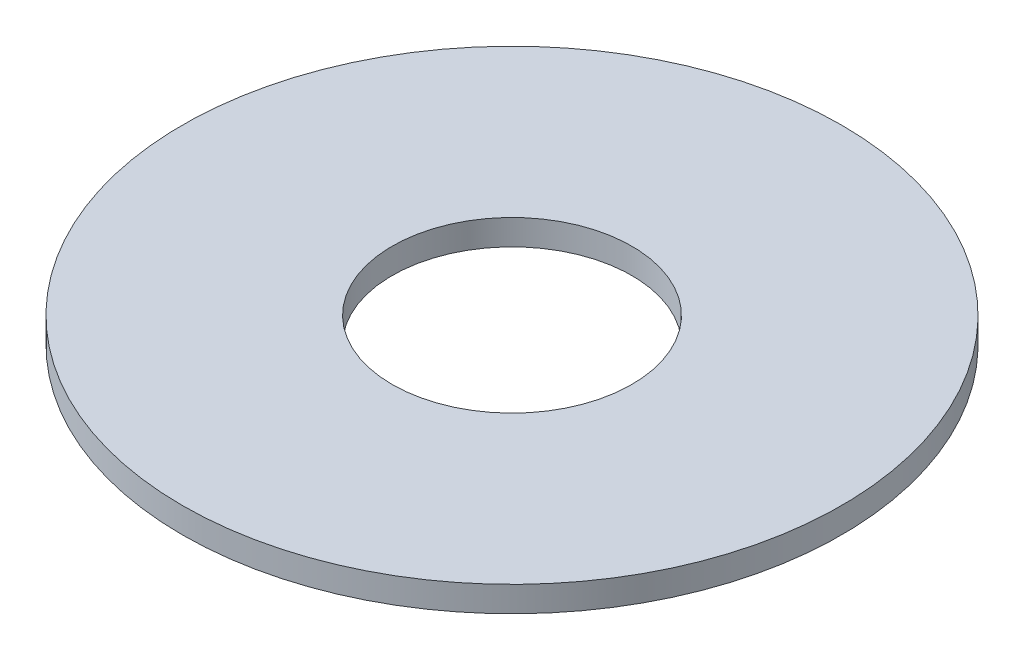
ISO-10303-21;
HEADER;
FILE_DESCRIPTION(('STEP AP214'),'2;1');
FILE_NAME('part.step','',(''),(''),'','','');
FILE_SCHEMA(('AUTOMOTIVE_DESIGN { 1 0 10303 214 1 1 1 1 }'));
ENDSEC;
DATA;
#1=APPLICATION_CONTEXT('core data for automotive mechanical design processes');
#2=APPLICATION_PROTOCOL_DEFINITION('international standard','automotive_design',2000,#1);
#3=PRODUCT_CONTEXT('',#1,'mechanical');
#4=PRODUCT('Part','Part','',(#3));
#5=PRODUCT_RELATED_PRODUCT_CATEGORY('part','',(#4));
#6=PRODUCT_DEFINITION_FORMATION('','',#4);
#7=PRODUCT_DEFINITION_CONTEXT('part definition',#1,'design');
#8=PRODUCT_DEFINITION('design','',#6,#7);
#9=PRODUCT_DEFINITION_SHAPE('','',#8);
#10=(LENGTH_UNIT() NAMED_UNIT(*) SI_UNIT(.MILLI.,.METRE.));
#11=(NAMED_UNIT(*) PLANE_ANGLE_UNIT() SI_UNIT($,.RADIAN.));
#12=(NAMED_UNIT(*) SI_UNIT($,.STERADIAN.) SOLID_ANGLE_UNIT());
#13=UNCERTAINTY_MEASURE_WITH_UNIT(LENGTH_MEASURE(1.E-05),#10,'distance_accuracy_value','');
#14=(GEOMETRIC_REPRESENTATION_CONTEXT(3) GLOBAL_UNCERTAINTY_ASSIGNED_CONTEXT((#13)) GLOBAL_UNIT_ASSIGNED_CONTEXT((#10,
#11,#12)) REPRESENTATION_CONTEXT('',''));
#15=CARTESIAN_POINT('',(0.,0.,0.));
#16=DIRECTION('',(0.,0.,1.));
#17=DIRECTION('',(1.,0.,0.));
#18=AXIS2_PLACEMENT_3D('',#15,#16,#17);
#19=CARTESIAN_POINT('',(0.,0.,0.));
#20=DIRECTION('',(0.,1.,0.));
#21=DIRECTION('',(0.,0.,1.));
#22=AXIS2_PLACEMENT_3D('',#19,#20,#21);
#23=CYLINDRICAL_SURFACE('',#22,4.);
#24=CARTESIAN_POINT('',(0.,0.85,0.));
#25=DIRECTION('',(0.,1.,0.));
#26=DIRECTION('',(0.,0.,1.));
#27=AXIS2_PLACEMENT_3D('',#24,#25,#26);
#28=CIRCLE('',#27,4.);
#29=CARTESIAN_POINT('',(0.,0.85,4.));
#30=VERTEX_POINT('',#29);
#31=EDGE_CURVE('E10',#30,#30,#28,.T.);
#32=ORIENTED_EDGE('',*,*,#31,.T.);
#33=EDGE_LOOP('',(#32));
#34=FACE_BOUND('',#33,.T.);
#35=CARTESIAN_POINT('',(0.,0.,0.));
#36=DIRECTION('',(0.,1.,0.));
#37=DIRECTION('',(0.,0.,1.));
#38=AXIS2_PLACEMENT_3D('',#35,#36,#37);
#39=CIRCLE('',#38,4.);
#40=CARTESIAN_POINT('',(0.,0.,4.));
#41=VERTEX_POINT('',#40);
#42=EDGE_CURVE('E46',#41,#41,#39,.T.);
#43=ORIENTED_EDGE('',*,*,#42,.F.);
#44=EDGE_LOOP('',(#43));
#45=FACE_BOUND('',#44,.T.);
#46=ADVANCED_FACE('F32',(#34,#45),#23,.F.);
#47=CARTESIAN_POINT('',(4.,0.85,0.));
#48=DIRECTION('',(0.,1.,0.));
#49=DIRECTION('',(0.,0.,1.));
#50=AXIS2_PLACEMENT_3D('',#47,#48,#49);
#51=PLANE('',#50);
#52=CARTESIAN_POINT('',(0.,0.85,0.));
#53=DIRECTION('',(0.,1.,0.));
#54=DIRECTION('',(0.,0.,1.));
#55=AXIS2_PLACEMENT_3D('',#52,#53,#54);
#56=CIRCLE('',#55,11.);
#57=CARTESIAN_POINT('',(0.,0.85,11.));
#58=VERTEX_POINT('',#57);
#59=EDGE_CURVE('E38',#58,#58,#56,.T.);
#60=ORIENTED_EDGE('',*,*,#59,.T.);
#61=EDGE_LOOP('',(#60));
#62=FACE_BOUND('',#61,.T.);
#63=ORIENTED_EDGE('',*,*,#31,.F.);
#64=EDGE_LOOP('',(#63));
#65=FACE_BOUND('',#64,.T.);
#66=ADVANCED_FACE('F56',(#62,#65),#51,.T.);
#67=CARTESIAN_POINT('',(0.,0.,0.));
#68=DIRECTION('',(0.,1.,0.));
#69=DIRECTION('',(0.,0.,1.));
#70=AXIS2_PLACEMENT_3D('',#67,#68,#69);
#71=CYLINDRICAL_SURFACE('',#70,11.);
#72=CARTESIAN_POINT('',(0.,0.,0.));
#73=DIRECTION('',(0.,1.,0.));
#74=DIRECTION('',(0.,0.,1.));
#75=AXIS2_PLACEMENT_3D('',#72,#73,#74);
#76=CIRCLE('',#75,11.);
#77=CARTESIAN_POINT('',(0.,0.,11.));
#78=VERTEX_POINT('',#77);
#79=EDGE_CURVE('E42',#78,#78,#76,.T.);
#80=ORIENTED_EDGE('',*,*,#79,.T.);
#81=EDGE_LOOP('',(#80));
#82=FACE_BOUND('',#81,.T.);
#83=ORIENTED_EDGE('',*,*,#59,.F.);
#84=EDGE_LOOP('',(#83));
#85=FACE_BOUND('',#84,.T.);
#86=ADVANCED_FACE('F60',(#82,#85),#71,.T.);
#87=CARTESIAN_POINT('',(11.,0.,0.));
#88=DIRECTION('',(0.,-1.,0.));
#89=DIRECTION('',(0.,0.,-1.));
#90=AXIS2_PLACEMENT_3D('',#87,#88,#89);
#91=PLANE('',#90);
#92=ORIENTED_EDGE('',*,*,#42,.T.);
#93=EDGE_LOOP('',(#92));
#94=FACE_BOUND('',#93,.T.);
#95=ORIENTED_EDGE('',*,*,#79,.F.);
#96=EDGE_LOOP('',(#95));
#97=FACE_BOUND('',#96,.T.);
#98=ADVANCED_FACE('F52',(#94,#97),#91,.T.);
#99=CLOSED_SHELL('',(#46,#66,#86,#98));
#100=MANIFOLD_SOLID_BREP('B2',#99);
#101=ADVANCED_BREP_SHAPE_REPRESENTATION('',(#18,#100),#14);
#102=SHAPE_DEFINITION_REPRESENTATION(#9,#101);
ENDSEC;
END-ISO-10303-21;
